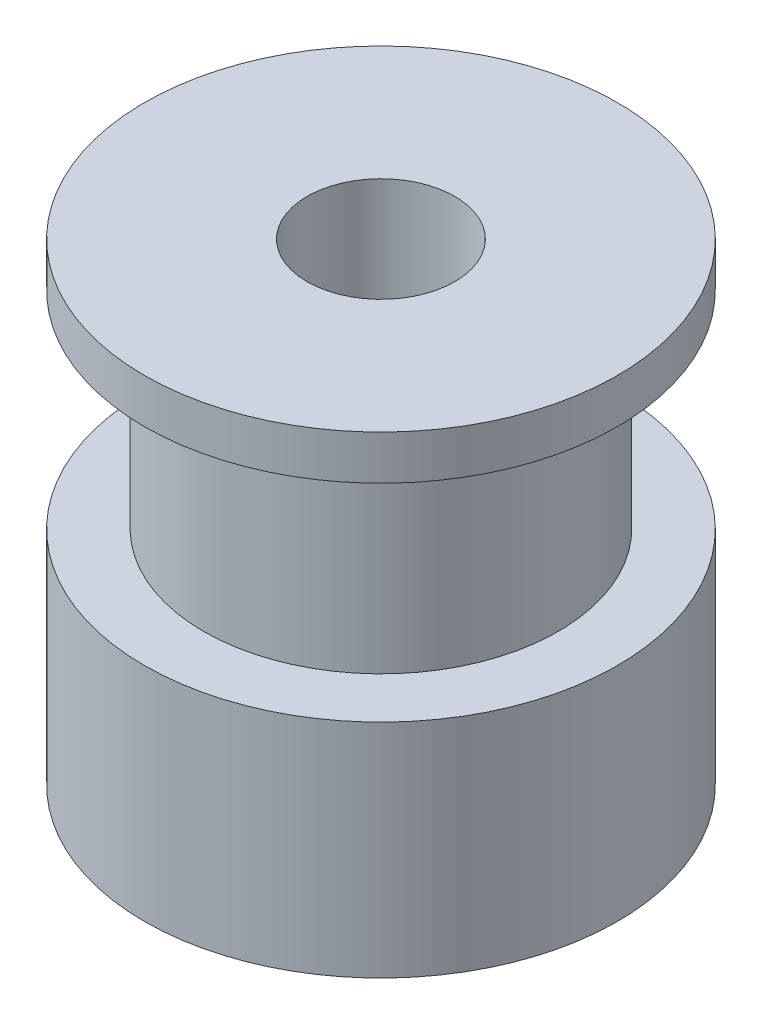
ISO-10303-21;
HEADER;
FILE_DESCRIPTION(('STEP AP214'),'2;1');
FILE_NAME('part.step','',(''),(''),'','','');
FILE_SCHEMA(('AUTOMOTIVE_DESIGN { 1 0 10303 214 1 1 1 1 }'));
ENDSEC;
DATA;
#1=APPLICATION_CONTEXT('core data for automotive mechanical design processes');
#2=APPLICATION_PROTOCOL_DEFINITION('international standard','automotive_design',2000,#1);
#3=PRODUCT_CONTEXT('',#1,'mechanical');
#4=PRODUCT('Part','Part','',(#3));
#5=PRODUCT_RELATED_PRODUCT_CATEGORY('part','',(#4));
#6=PRODUCT_DEFINITION_FORMATION('','',#4);
#7=PRODUCT_DEFINITION_CONTEXT('part definition',#1,'design');
#8=PRODUCT_DEFINITION('design','',#6,#7);
#9=PRODUCT_DEFINITION_SHAPE('','',#8);
#10=(LENGTH_UNIT() NAMED_UNIT(*) SI_UNIT(.MILLI.,.METRE.));
#11=(NAMED_UNIT(*) PLANE_ANGLE_UNIT() SI_UNIT($,.RADIAN.));
#12=(NAMED_UNIT(*) SI_UNIT($,.STERADIAN.) SOLID_ANGLE_UNIT());
#13=UNCERTAINTY_MEASURE_WITH_UNIT(LENGTH_MEASURE(1.E-05),#10,'distance_accuracy_value','');
#14=(GEOMETRIC_REPRESENTATION_CONTEXT(3) GLOBAL_UNCERTAINTY_ASSIGNED_CONTEXT((#13)) GLOBAL_UNIT_ASSIGNED_CONTEXT((#10,
#11,#12)) REPRESENTATION_CONTEXT('',''));
#15=CARTESIAN_POINT('',(0.,0.,0.));
#16=DIRECTION('',(0.,0.,1.));
#17=DIRECTION('',(1.,0.,0.));
#18=AXIS2_PLACEMENT_3D('',#15,#16,#17);
#19=CARTESIAN_POINT('',(0.,15.0123580387965,0.));
#20=DIRECTION('',(0.,1.,0.));
#21=DIRECTION('',(0.,0.,1.));
#22=AXIS2_PLACEMENT_3D('',#19,#20,#21);
#23=CYLINDRICAL_SURFACE('',#22,8.);
#24=CARTESIAN_POINT('',(0.,16.,0.));
#25=DIRECTION('',(0.,1.,0.));
#26=DIRECTION('',(0.,0.,1.));
#27=AXIS2_PLACEMENT_3D('',#24,#25,#26);
#28=CIRCLE('',#27,8.);
#29=CARTESIAN_POINT('',(0.,16.,8.));
#30=VERTEX_POINT('',#29);
#31=EDGE_CURVE('E58',#30,#30,#28,.T.);
#32=ORIENTED_EDGE('',*,*,#31,.F.);
#33=EDGE_LOOP('',(#32));
#34=FACE_BOUND('',#33,.T.);
#35=CARTESIAN_POINT('',(0.,14.5,0.));
#36=DIRECTION('',(0.,1.,0.));
#37=DIRECTION('',(0.,0.,1.));
#38=AXIS2_PLACEMENT_3D('',#35,#36,#37);
#39=CIRCLE('',#38,8.);
#40=CARTESIAN_POINT('',(0.,14.5,8.));
#41=VERTEX_POINT('',#40);
#42=EDGE_CURVE('E10',#41,#41,#39,.T.);
#43=ORIENTED_EDGE('',*,*,#42,.T.);
#44=EDGE_LOOP('',(#43));
#45=FACE_BOUND('',#44,.T.);
#46=ADVANCED_FACE('F30',(#34,#45),#23,.T.);
#47=CARTESIAN_POINT('',(8.,14.5,0.));
#48=DIRECTION('',(0.,1.,0.));
#49=DIRECTION('',(0.,0.,1.));
#50=AXIS2_PLACEMENT_3D('',#47,#48,#49);
#51=PLANE('',#50);
#52=ORIENTED_EDGE('',*,*,#42,.F.);
#53=EDGE_LOOP('',(#52));
#54=FACE_BOUND('',#53,.T.);
#55=CARTESIAN_POINT('',(0.,14.5,0.));
#56=DIRECTION('',(0.,1.,0.));
#57=DIRECTION('',(0.,0.,1.));
#58=AXIS2_PLACEMENT_3D('',#55,#56,#57);
#59=CIRCLE('',#58,6.);
#60=CARTESIAN_POINT('',(0.,14.5,6.));
#61=VERTEX_POINT('',#60);
#62=EDGE_CURVE('E36',#61,#61,#59,.T.);
#63=ORIENTED_EDGE('',*,*,#62,.T.);
#64=EDGE_LOOP('',(#63));
#65=FACE_BOUND('',#64,.T.);
#66=ADVANCED_FACE('F65',(#54,#65),#51,.F.);
#67=CARTESIAN_POINT('',(0.,15.0123580387965,0.));
#68=DIRECTION('',(0.,1.,0.));
#69=DIRECTION('',(0.,0.,1.));
#70=AXIS2_PLACEMENT_3D('',#67,#68,#69);
#71=CYLINDRICAL_SURFACE('',#70,6.);
#72=ORIENTED_EDGE('',*,*,#62,.F.);
#73=EDGE_LOOP('',(#72));
#74=FACE_BOUND('',#73,.T.);
#75=CARTESIAN_POINT('',(0.,7.5,0.));
#76=DIRECTION('',(0.,1.,0.));
#77=DIRECTION('',(0.,0.,1.));
#78=AXIS2_PLACEMENT_3D('',#75,#76,#77);
#79=CIRCLE('',#78,6.);
#80=CARTESIAN_POINT('',(0.,7.5,6.));
#81=VERTEX_POINT('',#80);
#82=EDGE_CURVE('E40',#81,#81,#79,.T.);
#83=ORIENTED_EDGE('',*,*,#82,.T.);
#84=EDGE_LOOP('',(#83));
#85=FACE_BOUND('',#84,.T.);
#86=ADVANCED_FACE('F69',(#74,#85),#71,.T.);
#87=CARTESIAN_POINT('',(6.,7.5,0.));
#88=DIRECTION('',(0.,-1.,0.));
#89=DIRECTION('',(0.,0.,-1.));
#90=AXIS2_PLACEMENT_3D('',#87,#88,#89);
#91=PLANE('',#90);
#92=ORIENTED_EDGE('',*,*,#82,.F.);
#93=EDGE_LOOP('',(#92));
#94=FACE_BOUND('',#93,.T.);
#95=CARTESIAN_POINT('',(0.,7.5,0.));
#96=DIRECTION('',(0.,1.,0.));
#97=DIRECTION('',(0.,0.,1.));
#98=AXIS2_PLACEMENT_3D('',#95,#96,#97);
#99=CIRCLE('',#98,8.);
#100=CARTESIAN_POINT('',(0.,7.5,8.));
#101=VERTEX_POINT('',#100);
#102=EDGE_CURVE('E44',#101,#101,#99,.T.);
#103=ORIENTED_EDGE('',*,*,#102,.T.);
#104=EDGE_LOOP('',(#103));
#105=FACE_BOUND('',#104,.T.);
#106=ADVANCED_FACE('F74',(#94,#105),#91,.F.);
#107=CARTESIAN_POINT('',(0.,15.0123580387965,0.));
#108=DIRECTION('',(0.,1.,0.));
#109=DIRECTION('',(0.,0.,1.));
#110=AXIS2_PLACEMENT_3D('',#107,#108,#109);
#111=CYLINDRICAL_SURFACE('',#110,8.);
#112=ORIENTED_EDGE('',*,*,#102,.F.);
#113=EDGE_LOOP('',(#112));
#114=FACE_BOUND('',#113,.T.);
#115=CARTESIAN_POINT('',(0.,0.,0.));
#116=DIRECTION('',(0.,1.,0.));
#117=DIRECTION('',(0.,0.,1.));
#118=AXIS2_PLACEMENT_3D('',#115,#116,#117);
#119=CIRCLE('',#118,8.);
#120=CARTESIAN_POINT('',(0.,0.,8.));
#121=VERTEX_POINT('',#120);
#122=EDGE_CURVE('E49',#121,#121,#119,.T.);
#123=ORIENTED_EDGE('',*,*,#122,.T.);
#124=EDGE_LOOP('',(#123));
#125=FACE_BOUND('',#124,.T.);
#126=ADVANCED_FACE('F80',(#114,#125),#111,.T.);
#127=CARTESIAN_POINT('',(8.,0.,0.));
#128=DIRECTION('',(0.,1.,0.));
#129=DIRECTION('',(0.,0.,1.));
#130=AXIS2_PLACEMENT_3D('',#127,#128,#129);
#131=PLANE('',#130);
#132=ORIENTED_EDGE('',*,*,#122,.F.);
#133=EDGE_LOOP('',(#132));
#134=FACE_BOUND('',#133,.T.);
#135=CARTESIAN_POINT('',(0.,0.,0.));
#136=DIRECTION('',(0.,1.,0.));
#137=DIRECTION('',(0.,0.,1.));
#138=AXIS2_PLACEMENT_3D('',#135,#136,#137);
#139=CIRCLE('',#138,2.5);
#140=CARTESIAN_POINT('',(0.,0.,2.5));
#141=VERTEX_POINT('',#140);
#142=EDGE_CURVE('E52',#141,#141,#139,.T.);
#143=ORIENTED_EDGE('',*,*,#142,.T.);
#144=EDGE_LOOP('',(#143));
#145=FACE_BOUND('',#144,.T.);
#146=ADVANCED_FACE('F84',(#134,#145),#131,.F.);
#147=CARTESIAN_POINT('',(0.,15.0123580387965,0.));
#148=DIRECTION('',(0.,1.,0.));
#149=DIRECTION('',(0.,0.,1.));
#150=AXIS2_PLACEMENT_3D('',#147,#148,#149);
#151=CYLINDRICAL_SURFACE('',#150,2.5);
#152=ORIENTED_EDGE('',*,*,#142,.F.);
#153=EDGE_LOOP('',(#152));
#154=FACE_BOUND('',#153,.T.);
#155=CARTESIAN_POINT('',(0.,16.,0.));
#156=DIRECTION('',(0.,1.,0.));
#157=DIRECTION('',(0.,0.,1.));
#158=AXIS2_PLACEMENT_3D('',#155,#156,#157);
#159=CIRCLE('',#158,2.5);
#160=CARTESIAN_POINT('',(0.,16.,2.5));
#161=VERTEX_POINT('',#160);
#162=EDGE_CURVE('E55',#161,#161,#159,.T.);
#163=ORIENTED_EDGE('',*,*,#162,.T.);
#164=EDGE_LOOP('',(#163));
#165=FACE_BOUND('',#164,.T.);
#166=ADVANCED_FACE('F88',(#154,#165),#151,.F.);
#167=CARTESIAN_POINT('',(2.5,16.,0.));
#168=DIRECTION('',(0.,-1.,0.));
#169=DIRECTION('',(0.,0.,-1.));
#170=AXIS2_PLACEMENT_3D('',#167,#168,#169);
#171=PLANE('',#170);
#172=ORIENTED_EDGE('',*,*,#162,.F.);
#173=EDGE_LOOP('',(#172));
#174=FACE_BOUND('',#173,.T.);
#175=ORIENTED_EDGE('',*,*,#31,.T.);
#176=EDGE_LOOP('',(#175));
#177=FACE_BOUND('',#176,.T.);
#178=ADVANCED_FACE('F62',(#174,#177),#171,.F.);
#179=CLOSED_SHELL('',(#46,#66,#86,#106,#126,#146,#166,#178));
#180=MANIFOLD_SOLID_BREP('B2',#179);
#181=ADVANCED_BREP_SHAPE_REPRESENTATION('',(#18,#180),#14);
#182=SHAPE_DEFINITION_REPRESENTATION(#9,#181);
ENDSEC;
END-ISO-10303-21;
